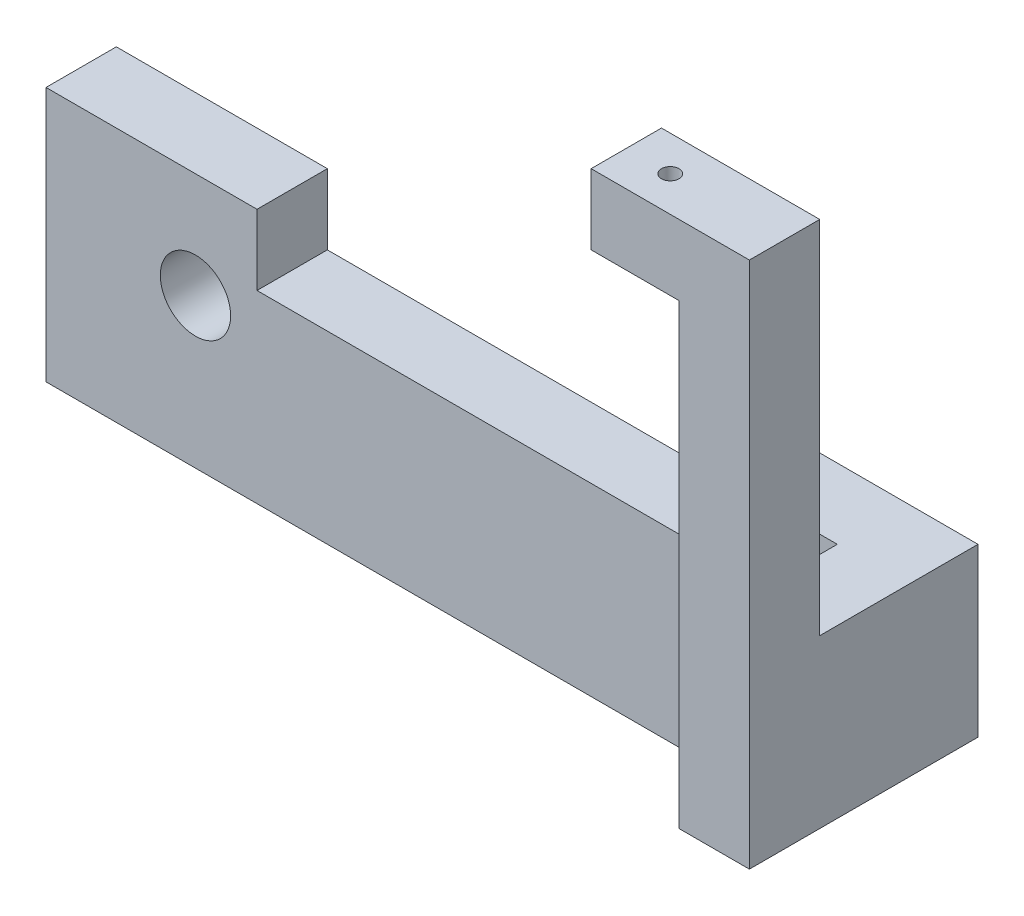
ISO-10303-21;
HEADER;
FILE_DESCRIPTION(('STEP AP214'),'2;1');
FILE_NAME('part.step','',(''),(''),'','','');
FILE_SCHEMA(('AUTOMOTIVE_DESIGN { 1 0 10303 214 1 1 1 1 }'));
ENDSEC;
DATA;
#1=APPLICATION_CONTEXT('core data for automotive mechanical design processes');
#2=APPLICATION_PROTOCOL_DEFINITION('international standard','automotive_design',2000,#1);
#3=PRODUCT_CONTEXT('',#1,'mechanical');
#4=PRODUCT('Part','Part','',(#3));
#5=PRODUCT_RELATED_PRODUCT_CATEGORY('part','',(#4));
#6=PRODUCT_DEFINITION_FORMATION('','',#4);
#7=PRODUCT_DEFINITION_CONTEXT('part definition',#1,'design');
#8=PRODUCT_DEFINITION('design','',#6,#7);
#9=PRODUCT_DEFINITION_SHAPE('','',#8);
#10=(LENGTH_UNIT() NAMED_UNIT(*) SI_UNIT(.MILLI.,.METRE.));
#11=(NAMED_UNIT(*) PLANE_ANGLE_UNIT() SI_UNIT($,.RADIAN.));
#12=(NAMED_UNIT(*) SI_UNIT($,.STERADIAN.) SOLID_ANGLE_UNIT());
#13=UNCERTAINTY_MEASURE_WITH_UNIT(LENGTH_MEASURE(1.E-05),#10,'distance_accuracy_value','');
#14=(GEOMETRIC_REPRESENTATION_CONTEXT(3) GLOBAL_UNCERTAINTY_ASSIGNED_CONTEXT((#13)) GLOBAL_UNIT_ASSIGNED_CONTEXT((#10,
#11,#12)) REPRESENTATION_CONTEXT('',''));
#15=CARTESIAN_POINT('',(0.,0.,0.));
#16=DIRECTION('',(0.,0.,1.));
#17=DIRECTION('',(1.,0.,0.));
#18=AXIS2_PLACEMENT_3D('',#15,#16,#17);
#19=CARTESIAN_POINT('',(-96.,14.5,13.));
#20=DIRECTION('',(1.,0.,0.));
#21=DIRECTION('',(0.,1.,0.));
#22=AXIS2_PLACEMENT_3D('',#19,#20,#21);
#23=PLANE('',#22);
#24=DIRECTION('',(0.,-1.,0.));
#25=VECTOR('',#24,1.);
#26=CARTESIAN_POINT('',(-96.,14.5,4.));
#27=LINE('',#26,#25);
#28=CARTESIAN_POINT('',(-96.,14.5,4.));
#29=VERTEX_POINT('',#28);
#30=CARTESIAN_POINT('',(-96.,0.,4.));
#31=VERTEX_POINT('',#30);
#32=EDGE_CURVE('E257',#29,#31,#27,.T.);
#33=ORIENTED_EDGE('',*,*,#32,.F.);
#34=DIRECTION('',(0.,0.,-1.));
#35=VECTOR('',#34,1.);
#36=CARTESIAN_POINT('',(-96.,14.5,13.));
#37=LINE('',#36,#35);
#38=CARTESIAN_POINT('',(-96.,14.5,0.));
#39=VERTEX_POINT('',#38);
#40=EDGE_CURVE('E232',#29,#39,#37,.T.);
#41=ORIENTED_EDGE('',*,*,#40,.T.);
#42=DIRECTION('',(0.,-1.,0.));
#43=VECTOR('',#42,1.);
#44=CARTESIAN_POINT('',(-96.,14.5,0.));
#45=LINE('',#44,#43);
#46=CARTESIAN_POINT('',(-96.,0.,0.));
#47=VERTEX_POINT('',#46);
#48=EDGE_CURVE('E203',#39,#47,#45,.T.);
#49=ORIENTED_EDGE('',*,*,#48,.T.);
#50=DIRECTION('',(0.,0.,-1.));
#51=VECTOR('',#50,1.);
#52=CARTESIAN_POINT('',(-96.,0.,13.));
#53=LINE('',#52,#51);
#54=EDGE_CURVE('E11',#31,#47,#53,.T.);
#55=ORIENTED_EDGE('',*,*,#54,.F.);
#56=EDGE_LOOP('',(#33,#41,#49,#55));
#57=FACE_BOUND('',#56,.T.);
#58=ADVANCED_FACE('F32',(#57),#23,.F.);
#59=CARTESIAN_POINT('',(-96.,0.,13.));
#60=DIRECTION('',(0.,1.,0.));
#61=DIRECTION('',(0.,0.,1.));
#62=AXIS2_PLACEMENT_3D('',#59,#60,#61);
#63=PLANE('',#62);
#64=DIRECTION('',(1.,0.,0.));
#65=VECTOR('',#64,1.);
#66=CARTESIAN_POINT('',(-96.,0.,4.));
#67=LINE('',#66,#65);
#68=CARTESIAN_POINT('',(-54.1208628408537,0.,4.));
#69=VERTEX_POINT('',#68);
#70=EDGE_CURVE('E264',#31,#69,#67,.T.);
#71=ORIENTED_EDGE('',*,*,#70,.F.);
#72=ORIENTED_EDGE('',*,*,#54,.T.);
#73=DIRECTION('',(1.,0.,0.));
#74=VECTOR('',#73,1.);
#75=CARTESIAN_POINT('',(-96.,0.,0.));
#76=LINE('',#75,#74);
#77=CARTESIAN_POINT('',(-54.1208628408537,0.,0.));
#78=VERTEX_POINT('',#77);
#79=EDGE_CURVE('E197',#47,#78,#76,.T.);
#80=ORIENTED_EDGE('',*,*,#79,.T.);
#81=DIRECTION('',(0.,0.,-1.));
#82=VECTOR('',#81,1.);
#83=CARTESIAN_POINT('',(-54.1208628408537,0.,13.));
#84=LINE('',#83,#82);
#85=EDGE_CURVE('E40',#69,#78,#84,.T.);
#86=ORIENTED_EDGE('',*,*,#85,.F.);
#87=EDGE_LOOP('',(#71,#72,#80,#86));
#88=FACE_BOUND('',#87,.T.);
#89=ADVANCED_FACE('F198',(#88),#63,.F.);
#90=CARTESIAN_POINT('',(-54.1208628408537,0.,13.));
#91=DIRECTION('',(-1.,0.,0.));
#92=DIRECTION('',(0.,0.,1.));
#93=AXIS2_PLACEMENT_3D('',#90,#91,#92);
#94=PLANE('',#93);
#95=DIRECTION('',(0.,1.,0.));
#96=VECTOR('',#95,1.);
#97=CARTESIAN_POINT('',(-54.1208628408537,0.,4.));
#98=LINE('',#97,#96);
#99=CARTESIAN_POINT('',(-54.1208628408537,5.,4.));
#100=VERTEX_POINT('',#99);
#101=EDGE_CURVE('E193',#69,#100,#98,.T.);
#102=ORIENTED_EDGE('',*,*,#101,.F.);
#103=ORIENTED_EDGE('',*,*,#85,.T.);
#104=DIRECTION('',(0.,1.,0.));
#105=VECTOR('',#104,1.);
#106=CARTESIAN_POINT('',(-54.1208628408537,0.,0.));
#107=LINE('',#106,#105);
#108=CARTESIAN_POINT('',(-54.1208628408537,5.,0.));
#109=VERTEX_POINT('',#108);
#110=EDGE_CURVE('E191',#78,#109,#107,.T.);
#111=ORIENTED_EDGE('',*,*,#110,.T.);
#112=DIRECTION('',(0.,0.,-1.));
#113=VECTOR('',#112,1.);
#114=CARTESIAN_POINT('',(-54.1208628408537,5.,13.));
#115=LINE('',#114,#113);
#116=EDGE_CURVE('E181',#100,#109,#115,.T.);
#117=ORIENTED_EDGE('',*,*,#116,.F.);
#118=EDGE_LOOP('',(#102,#103,#111,#117));
#119=FACE_BOUND('',#118,.T.);
#120=ADVANCED_FACE('F188',(#119),#94,.F.);
#121=CARTESIAN_POINT('',(-51.,14.5,13.));
#122=DIRECTION('',(0.,-1.,0.));
#123=DIRECTION('',(1.,0.,0.));
#124=AXIS2_PLACEMENT_3D('',#121,#122,#123);
#125=PLANE('',#124);
#126=DIRECTION('',(-1.,0.,0.));
#127=VECTOR('',#126,1.);
#128=CARTESIAN_POINT('',(-51.,14.5,4.));
#129=LINE('',#128,#127);
#130=CARTESIAN_POINT('',(-51.,14.5,4.));
#131=VERTEX_POINT('',#130);
#132=CARTESIAN_POINT('',(-59.,14.5,4.));
#133=VERTEX_POINT('',#132);
#134=EDGE_CURVE('E273',#131,#133,#129,.T.);
#135=ORIENTED_EDGE('',*,*,#134,.F.);
#136=DIRECTION('',(0.,0.,-1.));
#137=VECTOR('',#136,1.);
#138=CARTESIAN_POINT('',(-51.,14.5,9.));
#139=LINE('',#138,#137);
#140=CARTESIAN_POINT('',(-51.,14.5,9.));
#141=VERTEX_POINT('',#140);
#142=EDGE_CURVE('E255',#141,#131,#139,.T.);
#143=ORIENTED_EDGE('',*,*,#142,.F.);
#144=DIRECTION('',(-1.,0.,0.));
#145=VECTOR('',#144,1.);
#146=CARTESIAN_POINT('',(-47.,14.5,9.));
#147=LINE('',#146,#145);
#148=CARTESIAN_POINT('',(-47.,14.5,9.));
#149=VERTEX_POINT('',#148);
#150=EDGE_CURVE('E47',#149,#141,#147,.T.);
#151=ORIENTED_EDGE('',*,*,#150,.F.);
#152=DIRECTION('',(0.,0.,-1.));
#153=VECTOR('',#152,1.);
#154=CARTESIAN_POINT('',(-47.,14.5,9.));
#155=LINE('',#154,#153);
#156=CARTESIAN_POINT('',(-47.,14.5,0.));
#157=VERTEX_POINT('',#156);
#158=EDGE_CURVE('E259',#149,#157,#155,.T.);
#159=ORIENTED_EDGE('',*,*,#158,.T.);
#160=DIRECTION('',(-1.,0.,0.));
#161=VECTOR('',#160,1.);
#162=CARTESIAN_POINT('',(-51.,14.5,0.));
#163=LINE('',#162,#161);
#164=CARTESIAN_POINT('',(-59.,14.5,0.));
#165=VERTEX_POINT('',#164);
#166=EDGE_CURVE('E216',#157,#165,#163,.T.);
#167=ORIENTED_EDGE('',*,*,#166,.T.);
#168=DIRECTION('',(0.,0.,-1.));
#169=VECTOR('',#168,1.);
#170=CARTESIAN_POINT('',(-59.,14.5,13.));
#171=LINE('',#170,#169);
#172=EDGE_CURVE('E165',#133,#165,#171,.T.);
#173=ORIENTED_EDGE('',*,*,#172,.F.);
#174=EDGE_LOOP('',(#135,#143,#151,#159,#167,#173));
#175=FACE_BOUND('',#174,.T.);
#176=ADVANCED_FACE('F312',(#175),#125,.F.);
#177=CARTESIAN_POINT('',(-59.,14.5,13.));
#178=DIRECTION('',(1.,0.,0.));
#179=DIRECTION('',(0.,0.,-1.));
#180=AXIS2_PLACEMENT_3D('',#177,#178,#179);
#181=PLANE('',#180);
#182=DIRECTION('',(0.,-1.,0.));
#183=VECTOR('',#182,1.);
#184=CARTESIAN_POINT('',(-59.,14.5,4.));
#185=LINE('',#184,#183);
#186=CARTESIAN_POINT('',(-59.,10.5,4.));
#187=VERTEX_POINT('',#186);
#188=EDGE_CURVE('E275',#133,#187,#185,.T.);
#189=ORIENTED_EDGE('',*,*,#188,.F.);
#190=ORIENTED_EDGE('',*,*,#172,.T.);
#191=DIRECTION('',(0.,-1.,0.));
#192=VECTOR('',#191,1.);
#193=CARTESIAN_POINT('',(-59.,14.5,0.));
#194=LINE('',#193,#192);
#195=CARTESIAN_POINT('',(-59.,10.5,0.));
#196=VERTEX_POINT('',#195);
#197=EDGE_CURVE('E219',#165,#196,#194,.T.);
#198=ORIENTED_EDGE('',*,*,#197,.T.);
#199=DIRECTION('',(0.,0.,-1.));
#200=VECTOR('',#199,1.);
#201=CARTESIAN_POINT('',(-59.,10.5,13.));
#202=LINE('',#201,#200);
#203=EDGE_CURVE('E169',#187,#196,#202,.T.);
#204=ORIENTED_EDGE('',*,*,#203,.F.);
#205=EDGE_LOOP('',(#189,#190,#198,#204));
#206=FACE_BOUND('',#205,.T.);
#207=ADVANCED_FACE('F248',(#206),#181,.F.);
#208=CARTESIAN_POINT('',(-59.,10.5,13.));
#209=DIRECTION('',(0.,-1.,0.));
#210=DIRECTION('',(0.,0.,-1.));
#211=AXIS2_PLACEMENT_3D('',#208,#209,#210);
#212=PLANE('',#211);
#213=DIRECTION('',(-1.,0.,0.));
#214=VECTOR('',#213,1.);
#215=CARTESIAN_POINT('',(-59.,10.5,4.));
#216=LINE('',#215,#214);
#217=CARTESIAN_POINT('',(-84.,10.5,4.));
#218=VERTEX_POINT('',#217);
#219=EDGE_CURVE('E244',#187,#218,#216,.T.);
#220=ORIENTED_EDGE('',*,*,#219,.F.);
#221=ORIENTED_EDGE('',*,*,#203,.T.);
#222=DIRECTION('',(-1.,0.,0.));
#223=VECTOR('',#222,1.);
#224=CARTESIAN_POINT('',(-59.,10.5,0.));
#225=LINE('',#224,#223);
#226=CARTESIAN_POINT('',(-84.,10.5,0.));
#227=VERTEX_POINT('',#226);
#228=EDGE_CURVE('E222',#196,#227,#225,.T.);
#229=ORIENTED_EDGE('',*,*,#228,.T.);
#230=DIRECTION('',(0.,0.,-1.));
#231=VECTOR('',#230,1.);
#232=CARTESIAN_POINT('',(-84.,10.5,13.));
#233=LINE('',#232,#231);
#234=EDGE_CURVE('E236',#218,#227,#233,.T.);
#235=ORIENTED_EDGE('',*,*,#234,.F.);
#236=EDGE_LOOP('',(#220,#221,#229,#235));
#237=FACE_BOUND('',#236,.T.);
#238=ADVANCED_FACE('F240',(#237),#212,.F.);
#239=CARTESIAN_POINT('',(-84.,10.5,13.));
#240=DIRECTION('',(-1.,0.,0.));
#241=DIRECTION('',(0.,0.,1.));
#242=AXIS2_PLACEMENT_3D('',#239,#240,#241);
#243=PLANE('',#242);
#244=DIRECTION('',(0.,1.,0.));
#245=VECTOR('',#244,1.);
#246=CARTESIAN_POINT('',(-84.,10.5,4.));
#247=LINE('',#246,#245);
#248=CARTESIAN_POINT('',(-84.,14.5,4.));
#249=VERTEX_POINT('',#248);
#250=EDGE_CURVE('E55',#218,#249,#247,.T.);
#251=ORIENTED_EDGE('',*,*,#250,.F.);
#252=ORIENTED_EDGE('',*,*,#234,.T.);
#253=DIRECTION('',(0.,1.,0.));
#254=VECTOR('',#253,1.);
#255=CARTESIAN_POINT('',(-84.,10.5,0.));
#256=LINE('',#255,#254);
#257=CARTESIAN_POINT('',(-84.,14.5,0.));
#258=VERTEX_POINT('',#257);
#259=EDGE_CURVE('E225',#227,#258,#256,.T.);
#260=ORIENTED_EDGE('',*,*,#259,.T.);
#261=DIRECTION('',(0.,0.,-1.));
#262=VECTOR('',#261,1.);
#263=CARTESIAN_POINT('',(-84.,14.5,13.));
#264=LINE('',#263,#262);
#265=EDGE_CURVE('E234',#249,#258,#264,.T.);
#266=ORIENTED_EDGE('',*,*,#265,.F.);
#267=EDGE_LOOP('',(#251,#252,#260,#266));
#268=FACE_BOUND('',#267,.T.);
#269=ADVANCED_FACE('F253',(#268),#243,.F.);
#270=CARTESIAN_POINT('',(-84.,14.5,13.));
#271=DIRECTION('',(0.,-1.,0.));
#272=DIRECTION('',(1.,0.,0.));
#273=AXIS2_PLACEMENT_3D('',#270,#271,#272);
#274=PLANE('',#273);
#275=DIRECTION('',(-1.,0.,0.));
#276=VECTOR('',#275,1.);
#277=CARTESIAN_POINT('',(-84.,14.5,4.));
#278=LINE('',#277,#276);
#279=EDGE_CURVE('E254',#249,#29,#278,.T.);
#280=ORIENTED_EDGE('',*,*,#279,.F.);
#281=ORIENTED_EDGE('',*,*,#265,.T.);
#282=DIRECTION('',(-1.,0.,0.));
#283=VECTOR('',#282,1.);
#284=CARTESIAN_POINT('',(-84.,14.5,0.));
#285=LINE('',#284,#283);
#286=EDGE_CURVE('E228',#258,#39,#285,.T.);
#287=ORIENTED_EDGE('',*,*,#286,.T.);
#288=ORIENTED_EDGE('',*,*,#40,.F.);
#289=EDGE_LOOP('',(#280,#281,#287,#288));
#290=FACE_BOUND('',#289,.T.);
#291=ADVANCED_FACE('F302',(#290),#274,.F.);
#292=CARTESIAN_POINT('',(-87.5,8.5,13.));
#293=DIRECTION('',(0.,0.,-1.));
#294=DIRECTION('',(-1.,0.,0.));
#295=AXIS2_PLACEMENT_3D('',#292,#293,#294);
#296=CYLINDRICAL_SURFACE('',#295,2.00000000000001);
#297=CARTESIAN_POINT('',(-87.5,8.5,0.));
#298=DIRECTION('',(0.,0.,1.));
#299=DIRECTION('',(1.,0.,0.));
#300=AXIS2_PLACEMENT_3D('',#297,#298,#299);
#301=CIRCLE('',#300,2.00000000000001);
#302=CARTESIAN_POINT('',(-85.5,8.5,0.));
#303=VERTEX_POINT('',#302);
#304=EDGE_CURVE('E286',#303,#303,#301,.T.);
#305=ORIENTED_EDGE('',*,*,#304,.F.);
#306=EDGE_LOOP('',(#305));
#307=FACE_BOUND('',#306,.T.);
#308=CARTESIAN_POINT('',(-87.5,8.5,4.));
#309=DIRECTION('',(0.,0.,1.));
#310=DIRECTION('',(1.,0.,0.));
#311=AXIS2_PLACEMENT_3D('',#308,#309,#310);
#312=CIRCLE('',#311,2.00000000000001);
#313=CARTESIAN_POINT('',(-85.5,8.5,4.));
#314=VERTEX_POINT('',#313);
#315=EDGE_CURVE('E280',#314,#314,#312,.T.);
#316=ORIENTED_EDGE('',*,*,#315,.T.);
#317=EDGE_LOOP('',(#316));
#318=FACE_BOUND('',#317,.T.);
#319=ADVANCED_FACE('F369',(#307,#318),#296,.F.);
#320=CARTESIAN_POINT('',(-55.5,8.5,13.));
#321=DIRECTION('',(0.,0.,-1.));
#322=DIRECTION('',(-1.,0.,0.));
#323=AXIS2_PLACEMENT_3D('',#320,#321,#322);
#324=CYLINDRICAL_SURFACE('',#323,2.);
#325=CARTESIAN_POINT('',(-55.5,8.5,0.));
#326=DIRECTION('',(0.,0.,1.));
#327=DIRECTION('',(1.,0.,0.));
#328=AXIS2_PLACEMENT_3D('',#325,#326,#327);
#329=CIRCLE('',#328,2.);
#330=CARTESIAN_POINT('',(-53.5,8.5,0.));
#331=VERTEX_POINT('',#330);
#332=EDGE_CURVE('E283',#331,#331,#329,.T.);
#333=ORIENTED_EDGE('',*,*,#332,.F.);
#334=EDGE_LOOP('',(#333));
#335=FACE_BOUND('',#334,.T.);
#336=CARTESIAN_POINT('',(-55.5,8.5,4.));
#337=DIRECTION('',(0.,0.,1.));
#338=DIRECTION('',(1.,0.,0.));
#339=AXIS2_PLACEMENT_3D('',#336,#337,#338);
#340=CIRCLE('',#339,2.);
#341=CARTESIAN_POINT('',(-53.5,8.5,4.));
#342=VERTEX_POINT('',#341);
#343=EDGE_CURVE('E35',#342,#342,#340,.T.);
#344=ORIENTED_EDGE('',*,*,#343,.T.);
#345=EDGE_LOOP('',(#344));
#346=FACE_BOUND('',#345,.T.);
#347=ADVANCED_FACE('F363',(#335,#346),#324,.F.);
#348=CARTESIAN_POINT('',(0.,0.,13.));
#349=DIRECTION('',(0.,0.,1.));
#350=DIRECTION('',(1.,0.,0.));
#351=AXIS2_PLACEMENT_3D('',#348,#349,#350);
#352=PLANE('',#351);
#353=DIRECTION('',(0.,-1.,0.));
#354=VECTOR('',#353,1.);
#355=CARTESIAN_POINT('',(-51.,31.,13.));
#356=LINE('',#355,#354);
#357=CARTESIAN_POINT('',(-51.,31.,13.));
#358=VERTEX_POINT('',#357);
#359=CARTESIAN_POINT('',(-51.,5.,13.));
#360=VERTEX_POINT('',#359);
#361=EDGE_CURVE('E164',#358,#360,#356,.T.);
#362=ORIENTED_EDGE('',*,*,#361,.T.);
#363=DIRECTION('',(1.,0.,0.));
#364=VECTOR('',#363,1.);
#365=CARTESIAN_POINT('',(-54.1208628408537,5.,13.));
#366=LINE('',#365,#364);
#367=CARTESIAN_POINT('',(-47.,5.,13.));
#368=VERTEX_POINT('',#367);
#369=EDGE_CURVE('E231',#360,#368,#366,.T.);
#370=ORIENTED_EDGE('',*,*,#369,.T.);
#371=DIRECTION('',(0.,1.,0.));
#372=VECTOR('',#371,1.);
#373=CARTESIAN_POINT('',(-47.,5.,13.));
#374=LINE('',#373,#372);
#375=CARTESIAN_POINT('',(-47.,35.,13.));
#376=VERTEX_POINT('',#375);
#377=EDGE_CURVE('E290',#368,#376,#374,.T.);
#378=ORIENTED_EDGE('',*,*,#377,.T.);
#379=DIRECTION('',(-1.,0.,0.));
#380=VECTOR('',#379,1.);
#381=CARTESIAN_POINT('',(-47.,35.,13.));
#382=LINE('',#381,#380);
#383=CARTESIAN_POINT('',(-56.,35.,13.));
#384=VERTEX_POINT('',#383);
#385=EDGE_CURVE('E292',#376,#384,#382,.T.);
#386=ORIENTED_EDGE('',*,*,#385,.T.);
#387=DIRECTION('',(0.,-1.,0.));
#388=VECTOR('',#387,1.);
#389=CARTESIAN_POINT('',(-56.,35.,13.));
#390=LINE('',#389,#388);
#391=CARTESIAN_POINT('',(-56.,31.,13.));
#392=VERTEX_POINT('',#391);
#393=EDGE_CURVE('E294',#384,#392,#390,.T.);
#394=ORIENTED_EDGE('',*,*,#393,.T.);
#395=DIRECTION('',(1.,0.,0.));
#396=VECTOR('',#395,1.);
#397=CARTESIAN_POINT('',(-51.,31.,13.));
#398=LINE('',#397,#396);
#399=EDGE_CURVE('E296',#392,#358,#398,.T.);
#400=ORIENTED_EDGE('',*,*,#399,.T.);
#401=EDGE_LOOP('',(#362,#370,#378,#386,#394,#400));
#402=FACE_BOUND('',#401,.T.);
#403=ADVANCED_FACE('F322',(#402),#352,.T.);
#404=CARTESIAN_POINT('',(0.,0.,0.));
#405=DIRECTION('',(0.,0.,1.));
#406=DIRECTION('',(1.,0.,0.));
#407=AXIS2_PLACEMENT_3D('',#404,#405,#406);
#408=PLANE('',#407);
#409=ORIENTED_EDGE('',*,*,#166,.F.);
#410=DIRECTION('',(0.,1.,0.));
#411=VECTOR('',#410,1.);
#412=CARTESIAN_POINT('',(-47.,14.5,0.));
#413=LINE('',#412,#411);
#414=CARTESIAN_POINT('',(-47.,5.,0.));
#415=VERTEX_POINT('',#414);
#416=EDGE_CURVE('E210',#415,#157,#413,.T.);
#417=ORIENTED_EDGE('',*,*,#416,.F.);
#418=DIRECTION('',(1.,0.,0.));
#419=VECTOR('',#418,1.);
#420=CARTESIAN_POINT('',(-54.1208628408537,5.,0.));
#421=LINE('',#420,#419);
#422=EDGE_CURVE('E208',#109,#415,#421,.T.);
#423=ORIENTED_EDGE('',*,*,#422,.F.);
#424=ORIENTED_EDGE('',*,*,#110,.F.);
#425=ORIENTED_EDGE('',*,*,#79,.F.);
#426=ORIENTED_EDGE('',*,*,#48,.F.);
#427=ORIENTED_EDGE('',*,*,#286,.F.);
#428=ORIENTED_EDGE('',*,*,#259,.F.);
#429=ORIENTED_EDGE('',*,*,#228,.F.);
#430=ORIENTED_EDGE('',*,*,#197,.F.);
#431=EDGE_LOOP('',(#409,#417,#423,#424,#425,#426,#427,#428,#429,#430));
#432=FACE_BOUND('',#431,.T.);
#433=ORIENTED_EDGE('',*,*,#304,.T.);
#434=EDGE_LOOP('',(#433));
#435=FACE_BOUND('',#434,.T.);
#436=ORIENTED_EDGE('',*,*,#332,.T.);
#437=EDGE_LOOP('',(#436));
#438=FACE_BOUND('',#437,.T.);
#439=ADVANCED_FACE('F205',(#432,#435,#438),#408,.F.);
#440=CARTESIAN_POINT('',(-54.1208628408537,5.,13.));
#441=DIRECTION('',(0.,1.,0.));
#442=DIRECTION('',(0.,0.,1.));
#443=AXIS2_PLACEMENT_3D('',#440,#441,#442);
#444=PLANE('',#443);
#445=ORIENTED_EDGE('',*,*,#369,.F.);
#446=DIRECTION('',(0.,0.,1.));
#447=VECTOR('',#446,1.);
#448=CARTESIAN_POINT('',(-51.,5.,4.));
#449=LINE('',#448,#447);
#450=CARTESIAN_POINT('',(-51.,5.,4.));
#451=VERTEX_POINT('',#450);
#452=EDGE_CURVE('E278',#451,#360,#449,.T.);
#453=ORIENTED_EDGE('',*,*,#452,.F.);
#454=DIRECTION('',(1.,0.,0.));
#455=VECTOR('',#454,1.);
#456=CARTESIAN_POINT('',(-54.1208628408537,5.,4.));
#457=LINE('',#456,#455);
#458=EDGE_CURVE('E267',#100,#451,#457,.T.);
#459=ORIENTED_EDGE('',*,*,#458,.F.);
#460=ORIENTED_EDGE('',*,*,#116,.T.);
#461=ORIENTED_EDGE('',*,*,#422,.T.);
#462=DIRECTION('',(0.,0.,-1.));
#463=VECTOR('',#462,1.);
#464=CARTESIAN_POINT('',(-47.,5.,13.));
#465=LINE('',#464,#463);
#466=EDGE_CURVE('E178',#368,#415,#465,.T.);
#467=ORIENTED_EDGE('',*,*,#466,.F.);
#468=EDGE_LOOP('',(#445,#453,#459,#460,#461,#467));
#469=FACE_BOUND('',#468,.T.);
#470=ADVANCED_FACE('F308',(#469),#444,.F.);
#471=CARTESIAN_POINT('',(-47.,14.5,13.));
#472=DIRECTION('',(-1.,0.,0.));
#473=DIRECTION('',(0.,0.,1.));
#474=AXIS2_PLACEMENT_3D('',#471,#472,#473);
#475=PLANE('',#474);
#476=ORIENTED_EDGE('',*,*,#416,.T.);
#477=ORIENTED_EDGE('',*,*,#158,.F.);
#478=DIRECTION('',(0.,-1.,0.));
#479=VECTOR('',#478,1.);
#480=CARTESIAN_POINT('',(-47.,35.,9.));
#481=LINE('',#480,#479);
#482=CARTESIAN_POINT('',(-47.,35.,9.));
#483=VERTEX_POINT('',#482);
#484=EDGE_CURVE('E330',#483,#149,#481,.T.);
#485=ORIENTED_EDGE('',*,*,#484,.F.);
#486=DIRECTION('',(0.,0.,-1.));
#487=VECTOR('',#486,1.);
#488=CARTESIAN_POINT('',(-47.,35.,13.));
#489=LINE('',#488,#487);
#490=EDGE_CURVE('E175',#376,#483,#489,.T.);
#491=ORIENTED_EDGE('',*,*,#490,.F.);
#492=ORIENTED_EDGE('',*,*,#377,.F.);
#493=ORIENTED_EDGE('',*,*,#466,.T.);
#494=EDGE_LOOP('',(#476,#477,#485,#491,#492,#493));
#495=FACE_BOUND('',#494,.T.);
#496=ADVANCED_FACE('F317',(#495),#475,.F.);
#497=CARTESIAN_POINT('',(-51.,35.,13.));
#498=DIRECTION('',(0.,-1.,0.));
#499=DIRECTION('',(0.,0.,-1.));
#500=AXIS2_PLACEMENT_3D('',#497,#498,#499);
#501=PLANE('',#500);
#502=CARTESIAN_POINT('',(-53.5,35.,11.));
#503=DIRECTION('',(0.,-1.,0.));
#504=DIRECTION('',(0.,0.,-1.));
#505=AXIS2_PLACEMENT_3D('',#502,#503,#504);
#506=CIRCLE('',#505,0.499999999999999);
#507=CARTESIAN_POINT('',(-53.5,35.,10.5));
#508=VERTEX_POINT('',#507);
#509=EDGE_CURVE('E149',#508,#508,#506,.F.);
#510=ORIENTED_EDGE('',*,*,#509,.F.);
#511=EDGE_LOOP('',(#510));
#512=FACE_BOUND('',#511,.T.);
#513=ORIENTED_EDGE('',*,*,#490,.T.);
#514=DIRECTION('',(1.,0.,0.));
#515=VECTOR('',#514,1.);
#516=CARTESIAN_POINT('',(-56.,35.,9.));
#517=LINE('',#516,#515);
#518=CARTESIAN_POINT('',(-56.,35.,9.));
#519=VERTEX_POINT('',#518);
#520=EDGE_CURVE('E328',#519,#483,#517,.T.);
#521=ORIENTED_EDGE('',*,*,#520,.F.);
#522=DIRECTION('',(0.,0.,-1.));
#523=VECTOR('',#522,1.);
#524=CARTESIAN_POINT('',(-56.,35.,13.));
#525=LINE('',#524,#523);
#526=EDGE_CURVE('E167',#384,#519,#525,.T.);
#527=ORIENTED_EDGE('',*,*,#526,.F.);
#528=ORIENTED_EDGE('',*,*,#385,.F.);
#529=EDGE_LOOP('',(#513,#521,#527,#528));
#530=FACE_BOUND('',#529,.T.);
#531=ADVANCED_FACE('F335',(#512,#530),#501,.F.);
#532=CARTESIAN_POINT('',(-56.,35.,13.));
#533=DIRECTION('',(1.,0.,0.));
#534=DIRECTION('',(0.,0.,-1.));
#535=AXIS2_PLACEMENT_3D('',#532,#533,#534);
#536=PLANE('',#535);
#537=ORIENTED_EDGE('',*,*,#526,.T.);
#538=DIRECTION('',(0.,1.,0.));
#539=VECTOR('',#538,1.);
#540=CARTESIAN_POINT('',(-56.,31.,9.));
#541=LINE('',#540,#539);
#542=CARTESIAN_POINT('',(-56.,31.,9.));
#543=VERTEX_POINT('',#542);
#544=EDGE_CURVE('E160',#543,#519,#541,.T.);
#545=ORIENTED_EDGE('',*,*,#544,.F.);
#546=DIRECTION('',(0.,0.,-1.));
#547=VECTOR('',#546,1.);
#548=CARTESIAN_POINT('',(-56.,31.,13.));
#549=LINE('',#548,#547);
#550=EDGE_CURVE('E159',#392,#543,#549,.T.);
#551=ORIENTED_EDGE('',*,*,#550,.F.);
#552=ORIENTED_EDGE('',*,*,#393,.F.);
#553=EDGE_LOOP('',(#537,#545,#551,#552));
#554=FACE_BOUND('',#553,.T.);
#555=ADVANCED_FACE('F326',(#554),#536,.F.);
#556=CARTESIAN_POINT('',(-51.,31.,13.));
#557=DIRECTION('',(0.,1.,0.));
#558=DIRECTION('',(0.,0.,1.));
#559=AXIS2_PLACEMENT_3D('',#556,#557,#558);
#560=PLANE('',#559);
#561=CARTESIAN_POINT('',(-53.5,31.,11.));
#562=DIRECTION('',(0.,-1.,0.));
#563=DIRECTION('',(0.,0.,-1.));
#564=AXIS2_PLACEMENT_3D('',#561,#562,#563);
#565=CIRCLE('',#564,0.499999999999999);
#566=CARTESIAN_POINT('',(-53.5,31.,10.5));
#567=VERTEX_POINT('',#566);
#568=EDGE_CURVE('E386',#567,#567,#565,.T.);
#569=ORIENTED_EDGE('',*,*,#568,.F.);
#570=EDGE_LOOP('',(#569));
#571=FACE_BOUND('',#570,.T.);
#572=ORIENTED_EDGE('',*,*,#550,.T.);
#573=DIRECTION('',(-1.,0.,0.));
#574=VECTOR('',#573,1.);
#575=CARTESIAN_POINT('',(-51.,31.,9.));
#576=LINE('',#575,#574);
#577=CARTESIAN_POINT('',(-51.,31.,9.));
#578=VERTEX_POINT('',#577);
#579=EDGE_CURVE('E145',#578,#543,#576,.T.);
#580=ORIENTED_EDGE('',*,*,#579,.F.);
#581=DIRECTION('',(0.,0.,-1.));
#582=VECTOR('',#581,1.);
#583=CARTESIAN_POINT('',(-51.,31.,13.));
#584=LINE('',#583,#582);
#585=EDGE_CURVE('E156',#358,#578,#584,.T.);
#586=ORIENTED_EDGE('',*,*,#585,.F.);
#587=ORIENTED_EDGE('',*,*,#399,.F.);
#588=EDGE_LOOP('',(#572,#580,#586,#587));
#589=FACE_BOUND('',#588,.T.);
#590=ADVANCED_FACE('F154',(#571,#589),#560,.F.);
#591=CARTESIAN_POINT('',(-51.,31.,13.));
#592=DIRECTION('',(1.,0.,0.));
#593=DIRECTION('',(0.,0.,-1.));
#594=AXIS2_PLACEMENT_3D('',#591,#592,#593);
#595=PLANE('',#594);
#596=DIRECTION('',(0.,1.,0.));
#597=VECTOR('',#596,1.);
#598=CARTESIAN_POINT('',(-51.,14.5,9.));
#599=LINE('',#598,#597);
#600=EDGE_CURVE('E142',#141,#578,#599,.T.);
#601=ORIENTED_EDGE('',*,*,#600,.F.);
#602=ORIENTED_EDGE('',*,*,#142,.T.);
#603=DIRECTION('',(0.,1.,0.));
#604=VECTOR('',#603,1.);
#605=CARTESIAN_POINT('',(-51.,5.,4.));
#606=LINE('',#605,#604);
#607=EDGE_CURVE('E270',#451,#131,#606,.T.);
#608=ORIENTED_EDGE('',*,*,#607,.F.);
#609=ORIENTED_EDGE('',*,*,#452,.T.);
#610=ORIENTED_EDGE('',*,*,#361,.F.);
#611=ORIENTED_EDGE('',*,*,#585,.T.);
#612=EDGE_LOOP('',(#601,#602,#608,#609,#610,#611));
#613=FACE_BOUND('',#612,.T.);
#614=ADVANCED_FACE('F162',(#613),#595,.F.);
#615=CARTESIAN_POINT('',(0.,0.,4.));
#616=DIRECTION('',(0.,0.,1.));
#617=DIRECTION('',(1.,0.,0.));
#618=AXIS2_PLACEMENT_3D('',#615,#616,#617);
#619=PLANE('',#618);
#620=ORIENTED_EDGE('',*,*,#315,.F.);
#621=EDGE_LOOP('',(#620));
#622=FACE_BOUND('',#621,.T.);
#623=ORIENTED_EDGE('',*,*,#343,.F.);
#624=EDGE_LOOP('',(#623));
#625=FACE_BOUND('',#624,.T.);
#626=ORIENTED_EDGE('',*,*,#250,.T.);
#627=ORIENTED_EDGE('',*,*,#279,.T.);
#628=ORIENTED_EDGE('',*,*,#32,.T.);
#629=ORIENTED_EDGE('',*,*,#70,.T.);
#630=ORIENTED_EDGE('',*,*,#101,.T.);
#631=ORIENTED_EDGE('',*,*,#458,.T.);
#632=ORIENTED_EDGE('',*,*,#607,.T.);
#633=ORIENTED_EDGE('',*,*,#134,.T.);
#634=ORIENTED_EDGE('',*,*,#188,.T.);
#635=ORIENTED_EDGE('',*,*,#219,.T.);
#636=EDGE_LOOP('',(#626,#627,#628,#629,#630,#631,#632,#633,#634,#635));
#637=FACE_BOUND('',#636,.T.);
#638=ADVANCED_FACE('F303',(#622,#625,#637),#619,.T.);
#639=CARTESIAN_POINT('',(0.,0.,9.));
#640=DIRECTION('',(0.,0.,1.));
#641=DIRECTION('',(1.,0.,0.));
#642=AXIS2_PLACEMENT_3D('',#639,#640,#641);
#643=PLANE('',#642);
#644=ORIENTED_EDGE('',*,*,#600,.T.);
#645=ORIENTED_EDGE('',*,*,#579,.T.);
#646=ORIENTED_EDGE('',*,*,#544,.T.);
#647=ORIENTED_EDGE('',*,*,#520,.T.);
#648=ORIENTED_EDGE('',*,*,#484,.T.);
#649=ORIENTED_EDGE('',*,*,#150,.T.);
#650=EDGE_LOOP('',(#644,#645,#646,#647,#648,#649));
#651=FACE_BOUND('',#650,.T.);
#652=ADVANCED_FACE('F144',(#651),#643,.F.);
#653=CARTESIAN_POINT('',(-53.5,36.4142135623731,11.));
#654=DIRECTION('',(0.,-1.,0.));
#655=DIRECTION('',(0.,0.,-1.));
#656=AXIS2_PLACEMENT_3D('',#653,#654,#655);
#657=CYLINDRICAL_SURFACE('',#656,0.499999999999999);
#658=ORIENTED_EDGE('',*,*,#509,.T.);
#659=EDGE_LOOP('',(#658));
#660=FACE_BOUND('',#659,.T.);
#661=ORIENTED_EDGE('',*,*,#568,.T.);
#662=EDGE_LOOP('',(#661));
#663=FACE_BOUND('',#662,.T.);
#664=ADVANCED_FACE('F392',(#660,#663),#657,.F.);
#665=CLOSED_SHELL('',(#58,#89,#120,#176,#207,#238,#269,#291,#319,#347,#403,#439,#470,#496,#531,
#555,#590,#614,#638,#652,#664));
#666=MANIFOLD_SOLID_BREP('B2',#665);
#667=ADVANCED_BREP_SHAPE_REPRESENTATION('',(#18,#666),#14);
#668=SHAPE_DEFINITION_REPRESENTATION(#9,#667);
ENDSEC;
END-ISO-10303-21;
